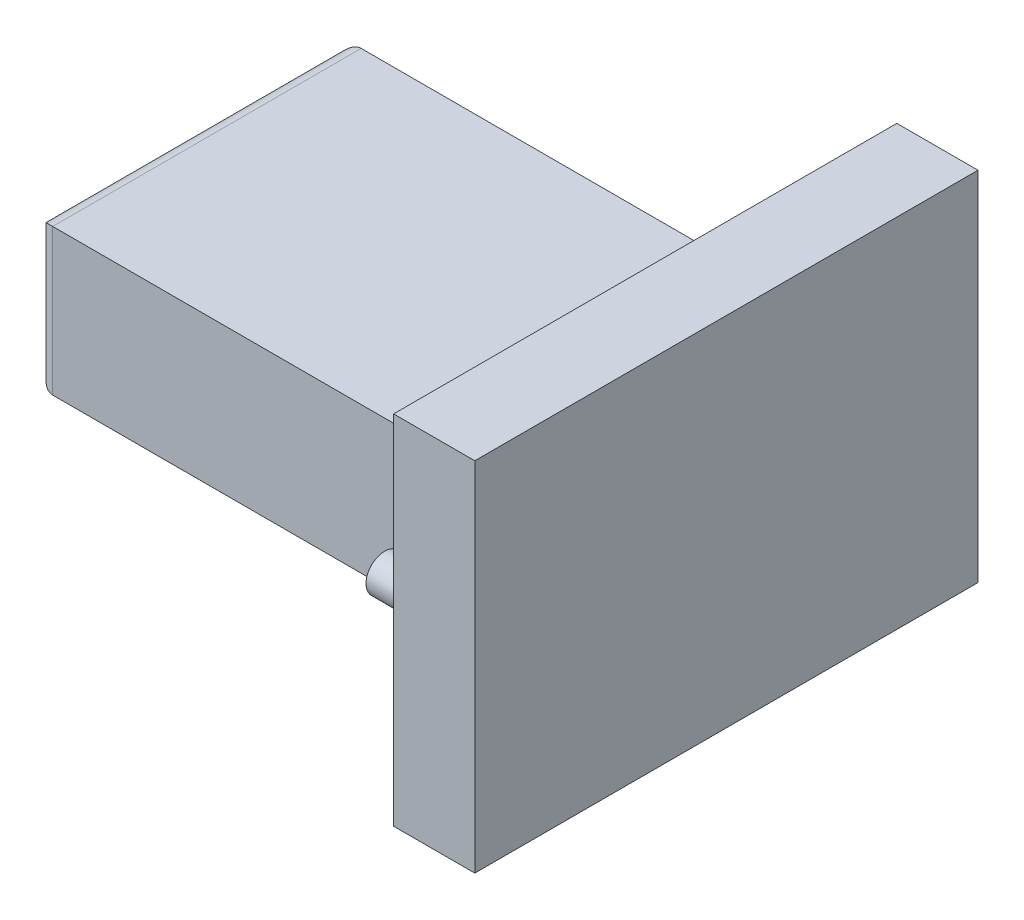
ISO-10303-21;
HEADER;
FILE_DESCRIPTION(('STEP AP214'),'2;1');
FILE_NAME('part.step','',(''),(''),'','','');
FILE_SCHEMA(('AUTOMOTIVE_DESIGN { 1 0 10303 214 1 1 1 1 }'));
ENDSEC;
DATA;
#1=APPLICATION_CONTEXT('core data for automotive mechanical design processes');
#2=APPLICATION_PROTOCOL_DEFINITION('international standard','automotive_design',2000,#1);
#3=PRODUCT_CONTEXT('',#1,'mechanical');
#4=PRODUCT('Part','Part','',(#3));
#5=PRODUCT_RELATED_PRODUCT_CATEGORY('part','',(#4));
#6=PRODUCT_DEFINITION_FORMATION('','',#4);
#7=PRODUCT_DEFINITION_CONTEXT('part definition',#1,'design');
#8=PRODUCT_DEFINITION('design','',#6,#7);
#9=PRODUCT_DEFINITION_SHAPE('','',#8);
#10=(LENGTH_UNIT() NAMED_UNIT(*) SI_UNIT(.MILLI.,.METRE.));
#11=(NAMED_UNIT(*) PLANE_ANGLE_UNIT() SI_UNIT($,.RADIAN.));
#12=(NAMED_UNIT(*) SI_UNIT($,.STERADIAN.) SOLID_ANGLE_UNIT());
#13=UNCERTAINTY_MEASURE_WITH_UNIT(LENGTH_MEASURE(1.E-05),#10,'distance_accuracy_value','');
#14=(GEOMETRIC_REPRESENTATION_CONTEXT(3) GLOBAL_UNCERTAINTY_ASSIGNED_CONTEXT((#13)) GLOBAL_UNIT_ASSIGNED_CONTEXT((#10,
#11,#12)) REPRESENTATION_CONTEXT('',''));
#15=CARTESIAN_POINT('',(0.,0.,0.));
#16=DIRECTION('',(0.,0.,1.));
#17=DIRECTION('',(1.,0.,0.));
#18=AXIS2_PLACEMENT_3D('',#15,#16,#17);
#19=CARTESIAN_POINT('',(5.,0.,0.));
#20=DIRECTION('',(0.,0.,-1.));
#21=DIRECTION('',(-1.,0.,0.));
#22=AXIS2_PLACEMENT_3D('',#19,#20,#21);
#23=PLANE('',#22);
#24=DIRECTION('',(0.,-1.,0.));
#25=VECTOR('',#24,1.);
#26=CARTESIAN_POINT('',(0.,0.,0.));
#27=LINE('',#26,#25);
#28=CARTESIAN_POINT('',(0.,22.,0.));
#29=VERTEX_POINT('',#28);
#30=CARTESIAN_POINT('',(0.,0.,0.));
#31=VERTEX_POINT('',#30);
#32=EDGE_CURVE('E152',#29,#31,#27,.T.);
#33=ORIENTED_EDGE('',*,*,#32,.T.);
#34=DIRECTION('',(-1.,0.,0.));
#35=VECTOR('',#34,1.);
#36=CARTESIAN_POINT('',(5.,0.,0.));
#37=LINE('',#36,#35);
#38=CARTESIAN_POINT('',(5.,0.,0.));
#39=VERTEX_POINT('',#38);
#40=EDGE_CURVE('E179',#39,#31,#37,.T.);
#41=ORIENTED_EDGE('',*,*,#40,.F.);
#42=DIRECTION('',(0.,-1.,0.));
#43=VECTOR('',#42,1.);
#44=CARTESIAN_POINT('',(5.,0.,0.));
#45=LINE('',#44,#43);
#46=CARTESIAN_POINT('',(5.,22.,0.));
#47=VERTEX_POINT('',#46);
#48=EDGE_CURVE('E153',#47,#39,#45,.T.);
#49=ORIENTED_EDGE('',*,*,#48,.F.);
#50=DIRECTION('',(-1.,0.,0.));
#51=VECTOR('',#50,1.);
#52=CARTESIAN_POINT('',(5.,22.,0.));
#53=LINE('',#52,#51);
#54=EDGE_CURVE('E163',#47,#29,#53,.T.);
#55=ORIENTED_EDGE('',*,*,#54,.T.);
#56=EDGE_LOOP('',(#33,#41,#49,#55));
#57=FACE_BOUND('',#56,.T.);
#58=ADVANCED_FACE('F45',(#57),#23,.F.);
#59=CARTESIAN_POINT('',(5.,0.,0.));
#60=DIRECTION('',(0.,1.,0.));
#61=DIRECTION('',(0.,0.,1.));
#62=AXIS2_PLACEMENT_3D('',#59,#60,#61);
#63=PLANE('',#62);
#64=DIRECTION('',(0.,0.,-1.));
#65=VECTOR('',#64,1.);
#66=CARTESIAN_POINT('',(0.,0.,0.));
#67=LINE('',#66,#65);
#68=CARTESIAN_POINT('',(0.,0.,-31.));
#69=VERTEX_POINT('',#68);
#70=EDGE_CURVE('E166',#31,#69,#67,.T.);
#71=ORIENTED_EDGE('',*,*,#70,.T.);
#72=DIRECTION('',(-1.,0.,0.));
#73=VECTOR('',#72,1.);
#74=CARTESIAN_POINT('',(5.,0.,-31.));
#75=LINE('',#74,#73);
#76=CARTESIAN_POINT('',(5.,0.,-31.));
#77=VERTEX_POINT('',#76);
#78=EDGE_CURVE('E176',#77,#69,#75,.T.);
#79=ORIENTED_EDGE('',*,*,#78,.F.);
#80=DIRECTION('',(0.,0.,-1.));
#81=VECTOR('',#80,1.);
#82=CARTESIAN_POINT('',(5.,0.,0.));
#83=LINE('',#82,#81);
#84=EDGE_CURVE('E156',#39,#77,#83,.T.);
#85=ORIENTED_EDGE('',*,*,#84,.F.);
#86=ORIENTED_EDGE('',*,*,#40,.T.);
#87=EDGE_LOOP('',(#71,#79,#85,#86));
#88=FACE_BOUND('',#87,.T.);
#89=ADVANCED_FACE('F229',(#88),#63,.F.);
#90=CARTESIAN_POINT('',(5.,0.,-31.));
#91=DIRECTION('',(0.,0.,1.));
#92=DIRECTION('',(1.,0.,0.));
#93=AXIS2_PLACEMENT_3D('',#90,#91,#92);
#94=PLANE('',#93);
#95=DIRECTION('',(0.,1.,0.));
#96=VECTOR('',#95,1.);
#97=CARTESIAN_POINT('',(0.,0.,-31.));
#98=LINE('',#97,#96);
#99=CARTESIAN_POINT('',(0.,22.,-31.));
#100=VERTEX_POINT('',#99);
#101=EDGE_CURVE('E168',#69,#100,#98,.T.);
#102=ORIENTED_EDGE('',*,*,#101,.T.);
#103=DIRECTION('',(-1.,0.,0.));
#104=VECTOR('',#103,1.);
#105=CARTESIAN_POINT('',(5.,22.,-31.));
#106=LINE('',#105,#104);
#107=CARTESIAN_POINT('',(5.,22.,-31.));
#108=VERTEX_POINT('',#107);
#109=EDGE_CURVE('E173',#108,#100,#106,.T.);
#110=ORIENTED_EDGE('',*,*,#109,.F.);
#111=DIRECTION('',(0.,1.,0.));
#112=VECTOR('',#111,1.);
#113=CARTESIAN_POINT('',(5.,0.,-31.));
#114=LINE('',#113,#112);
#115=EDGE_CURVE('E159',#77,#108,#114,.T.);
#116=ORIENTED_EDGE('',*,*,#115,.F.);
#117=ORIENTED_EDGE('',*,*,#78,.T.);
#118=EDGE_LOOP('',(#102,#110,#116,#117));
#119=FACE_BOUND('',#118,.T.);
#120=ADVANCED_FACE('F235',(#119),#94,.F.);
#121=CARTESIAN_POINT('',(5.,22.,0.));
#122=DIRECTION('',(0.,-1.,0.));
#123=DIRECTION('',(0.,0.,-1.));
#124=AXIS2_PLACEMENT_3D('',#121,#122,#123);
#125=PLANE('',#124);
#126=DIRECTION('',(0.,0.,1.));
#127=VECTOR('',#126,1.);
#128=CARTESIAN_POINT('',(0.,22.,0.));
#129=LINE('',#128,#127);
#130=EDGE_CURVE('E157',#100,#29,#129,.T.);
#131=ORIENTED_EDGE('',*,*,#130,.T.);
#132=ORIENTED_EDGE('',*,*,#54,.F.);
#133=DIRECTION('',(0.,0.,1.));
#134=VECTOR('',#133,1.);
#135=CARTESIAN_POINT('',(5.,22.,0.));
#136=LINE('',#135,#134);
#137=EDGE_CURVE('E161',#108,#47,#136,.T.);
#138=ORIENTED_EDGE('',*,*,#137,.F.);
#139=ORIENTED_EDGE('',*,*,#109,.T.);
#140=EDGE_LOOP('',(#131,#132,#138,#139));
#141=FACE_BOUND('',#140,.T.);
#142=ADVANCED_FACE('F302',(#141),#125,.F.);
#143=CARTESIAN_POINT('',(5.,0.,0.));
#144=DIRECTION('',(-1.,0.,0.));
#145=DIRECTION('',(0.,0.,1.));
#146=AXIS2_PLACEMENT_3D('',#143,#144,#145);
#147=PLANE('',#146);
#148=ORIENTED_EDGE('',*,*,#48,.T.);
#149=ORIENTED_EDGE('',*,*,#84,.T.);
#150=ORIENTED_EDGE('',*,*,#115,.T.);
#151=ORIENTED_EDGE('',*,*,#137,.T.);
#152=EDGE_LOOP('',(#148,#149,#150,#151));
#153=FACE_BOUND('',#152,.T.);
#154=ADVANCED_FACE('F299',(#153),#147,.F.);
#155=CARTESIAN_POINT('',(0.,0.,0.));
#156=DIRECTION('',(-1.,0.,0.));
#157=DIRECTION('',(0.,0.,1.));
#158=AXIS2_PLACEMENT_3D('',#155,#156,#157);
#159=PLANE('',#158);
#160=CARTESIAN_POINT('',(0.,11.,-28.75));
#161=DIRECTION('',(-1.,0.,0.));
#162=DIRECTION('',(0.,0.,1.));
#163=AXIS2_PLACEMENT_3D('',#160,#161,#162);
#164=CIRCLE('',#163,1.25);
#165=CARTESIAN_POINT('',(0.,11.,-27.5));
#166=VERTEX_POINT('',#165);
#167=EDGE_CURVE('E13',#166,#166,#164,.F.);
#168=ORIENTED_EDGE('',*,*,#167,.T.);
#169=EDGE_LOOP('',(#168));
#170=FACE_BOUND('',#169,.T.);
#171=CARTESIAN_POINT('',(0.,11.,-2.25));
#172=DIRECTION('',(-1.,0.,0.));
#173=DIRECTION('',(0.,0.,1.));
#174=AXIS2_PLACEMENT_3D('',#171,#172,#173);
#175=CIRCLE('',#174,1.25);
#176=CARTESIAN_POINT('',(0.,11.,-1.));
#177=VERTEX_POINT('',#176);
#178=EDGE_CURVE('E211',#177,#177,#175,.F.);
#179=ORIENTED_EDGE('',*,*,#178,.T.);
#180=EDGE_LOOP('',(#179));
#181=FACE_BOUND('',#180,.T.);
#182=DIRECTION('',(0.,-1.,0.));
#183=VECTOR('',#182,1.);
#184=CARTESIAN_POINT('',(0.,15.5,-25.));
#185=LINE('',#184,#183);
#186=CARTESIAN_POINT('',(0.,15.5,-25.));
#187=VERTEX_POINT('',#186);
#188=CARTESIAN_POINT('',(0.,6.5,-25.));
#189=VERTEX_POINT('',#188);
#190=EDGE_CURVE('E141',#187,#189,#185,.T.);
#191=ORIENTED_EDGE('',*,*,#190,.F.);
#192=DIRECTION('',(0.,0.,-1.));
#193=VECTOR('',#192,1.);
#194=CARTESIAN_POINT('',(0.,15.5,-25.));
#195=LINE('',#194,#193);
#196=CARTESIAN_POINT('',(0.,15.5,-6.));
#197=VERTEX_POINT('',#196);
#198=EDGE_CURVE('E138',#197,#187,#195,.T.);
#199=ORIENTED_EDGE('',*,*,#198,.F.);
#200=DIRECTION('',(0.,1.,0.));
#201=VECTOR('',#200,1.);
#202=CARTESIAN_POINT('',(0.,15.5,-6.));
#203=LINE('',#202,#201);
#204=CARTESIAN_POINT('',(0.,6.5,-6.));
#205=VERTEX_POINT('',#204);
#206=EDGE_CURVE('E124',#205,#197,#203,.T.);
#207=ORIENTED_EDGE('',*,*,#206,.F.);
#208=DIRECTION('',(0.,0.,1.));
#209=VECTOR('',#208,1.);
#210=CARTESIAN_POINT('',(0.,6.5,-25.));
#211=LINE('',#210,#209);
#212=EDGE_CURVE('E135',#189,#205,#211,.T.);
#213=ORIENTED_EDGE('',*,*,#212,.F.);
#214=EDGE_LOOP('',(#191,#199,#207,#213));
#215=FACE_BOUND('',#214,.T.);
#216=ORIENTED_EDGE('',*,*,#32,.F.);
#217=ORIENTED_EDGE('',*,*,#130,.F.);
#218=ORIENTED_EDGE('',*,*,#101,.F.);
#219=ORIENTED_EDGE('',*,*,#70,.F.);
#220=EDGE_LOOP('',(#216,#217,#218,#219));
#221=FACE_BOUND('',#220,.T.);
#222=ADVANCED_FACE('F133',(#170,#181,#215,#221),#159,.T.);
#223=CARTESIAN_POINT('',(-28.,15.5,-25.));
#224=DIRECTION('',(0.,0.,1.));
#225=DIRECTION('',(0.,-1.,0.));
#226=AXIS2_PLACEMENT_3D('',#223,#224,#225);
#227=PLANE('',#226);
#228=DIRECTION('',(1.,0.,0.));
#229=VECTOR('',#228,1.);
#230=CARTESIAN_POINT('',(-28.,6.5,-25.));
#231=LINE('',#230,#229);
#232=CARTESIAN_POINT('',(-27.,6.5,-25.));
#233=VERTEX_POINT('',#232);
#234=EDGE_CURVE('E126',#233,#189,#231,.T.);
#235=ORIENTED_EDGE('',*,*,#234,.F.);
#236=DIRECTION('',(0.,-1.,0.));
#237=VECTOR('',#236,1.);
#238=CARTESIAN_POINT('',(-27.,15.5,-25.));
#239=LINE('',#238,#237);
#240=CARTESIAN_POINT('',(-27.,15.5,-25.));
#241=VERTEX_POINT('',#240);
#242=EDGE_CURVE('E196',#233,#241,#239,.F.);
#243=ORIENTED_EDGE('',*,*,#242,.T.);
#244=DIRECTION('',(1.,0.,0.));
#245=VECTOR('',#244,1.);
#246=CARTESIAN_POINT('',(-28.,15.5,-25.));
#247=LINE('',#246,#245);
#248=EDGE_CURVE('E148',#241,#187,#247,.T.);
#249=ORIENTED_EDGE('',*,*,#248,.T.);
#250=ORIENTED_EDGE('',*,*,#190,.T.);
#251=EDGE_LOOP('',(#235,#243,#249,#250));
#252=FACE_BOUND('',#251,.T.);
#253=ADVANCED_FACE('F295',(#252),#227,.F.);
#254=CARTESIAN_POINT('',(-28.,6.5,-25.));
#255=DIRECTION('',(0.,1.,0.));
#256=DIRECTION('',(0.,0.,1.));
#257=AXIS2_PLACEMENT_3D('',#254,#255,#256);
#258=PLANE('',#257);
#259=DIRECTION('',(1.,0.,0.));
#260=VECTOR('',#259,1.);
#261=CARTESIAN_POINT('',(-28.,6.5,-6.));
#262=LINE('',#261,#260);
#263=CARTESIAN_POINT('',(-27.,6.5,-6.));
#264=VERTEX_POINT('',#263);
#265=EDGE_CURVE('E121',#264,#205,#262,.T.);
#266=ORIENTED_EDGE('',*,*,#265,.F.);
#267=DIRECTION('',(0.,0.,1.));
#268=VECTOR('',#267,1.);
#269=CARTESIAN_POINT('',(-27.,6.5,-25.));
#270=LINE('',#269,#268);
#271=EDGE_CURVE('E60',#264,#233,#270,.F.);
#272=ORIENTED_EDGE('',*,*,#271,.T.);
#273=ORIENTED_EDGE('',*,*,#234,.T.);
#274=ORIENTED_EDGE('',*,*,#212,.T.);
#275=EDGE_LOOP('',(#266,#272,#273,#274));
#276=FACE_BOUND('',#275,.T.);
#277=ADVANCED_FACE('F140',(#276),#258,.F.);
#278=CARTESIAN_POINT('',(-28.,15.5,-6.));
#279=DIRECTION('',(0.,0.,-1.));
#280=DIRECTION('',(-1.,0.,0.));
#281=AXIS2_PLACEMENT_3D('',#278,#279,#280);
#282=PLANE('',#281);
#283=DIRECTION('',(1.,0.,0.));
#284=VECTOR('',#283,1.);
#285=CARTESIAN_POINT('',(-28.,15.5,-6.));
#286=LINE('',#285,#284);
#287=CARTESIAN_POINT('',(-27.,15.5,-6.));
#288=VERTEX_POINT('',#287);
#289=EDGE_CURVE('E127',#288,#197,#286,.T.);
#290=ORIENTED_EDGE('',*,*,#289,.F.);
#291=DIRECTION('',(0.,1.,0.));
#292=VECTOR('',#291,1.);
#293=CARTESIAN_POINT('',(-27.,6.5,-6.));
#294=LINE('',#293,#292);
#295=EDGE_CURVE('E68',#288,#264,#294,.F.);
#296=ORIENTED_EDGE('',*,*,#295,.T.);
#297=ORIENTED_EDGE('',*,*,#265,.T.);
#298=ORIENTED_EDGE('',*,*,#206,.T.);
#299=EDGE_LOOP('',(#290,#296,#297,#298));
#300=FACE_BOUND('',#299,.T.);
#301=ADVANCED_FACE('F123',(#300),#282,.F.);
#302=CARTESIAN_POINT('',(-28.,15.5,-25.));
#303=DIRECTION('',(0.,-1.,0.));
#304=DIRECTION('',(0.,0.,-1.));
#305=AXIS2_PLACEMENT_3D('',#302,#303,#304);
#306=PLANE('',#305);
#307=ORIENTED_EDGE('',*,*,#248,.F.);
#308=DIRECTION('',(0.,0.,-1.));
#309=VECTOR('',#308,1.);
#310=CARTESIAN_POINT('',(-27.,15.5,-6.));
#311=LINE('',#310,#309);
#312=EDGE_CURVE('E191',#241,#288,#311,.F.);
#313=ORIENTED_EDGE('',*,*,#312,.T.);
#314=ORIENTED_EDGE('',*,*,#289,.T.);
#315=ORIENTED_EDGE('',*,*,#198,.T.);
#316=EDGE_LOOP('',(#307,#313,#314,#315));
#317=FACE_BOUND('',#316,.T.);
#318=ADVANCED_FACE('F286',(#317),#306,.F.);
#319=CARTESIAN_POINT('',(-28.,0.,0.));
#320=DIRECTION('',(-1.,0.,0.));
#321=DIRECTION('',(0.,0.,1.));
#322=AXIS2_PLACEMENT_3D('',#319,#320,#321);
#323=PLANE('',#322);
#324=DIRECTION('',(0.,1.,0.));
#325=VECTOR('',#324,1.);
#326=CARTESIAN_POINT('',(-28.,15.5,-7.));
#327=LINE('',#326,#325);
#328=CARTESIAN_POINT('',(-28.,7.5,-7.));
#329=VERTEX_POINT('',#328);
#330=CARTESIAN_POINT('',(-28.,14.5,-7.));
#331=VERTEX_POINT('',#330);
#332=EDGE_CURVE('E186',#329,#331,#327,.T.);
#333=ORIENTED_EDGE('',*,*,#332,.T.);
#334=DIRECTION('',(0.,0.,-1.));
#335=VECTOR('',#334,1.);
#336=CARTESIAN_POINT('',(-28.,14.5,-25.));
#337=LINE('',#336,#335);
#338=CARTESIAN_POINT('',(-28.,14.5,-24.));
#339=VERTEX_POINT('',#338);
#340=EDGE_CURVE('E188',#331,#339,#337,.T.);
#341=ORIENTED_EDGE('',*,*,#340,.T.);
#342=DIRECTION('',(0.,-1.,0.));
#343=VECTOR('',#342,1.);
#344=CARTESIAN_POINT('',(-28.,6.5,-24.));
#345=LINE('',#344,#343);
#346=CARTESIAN_POINT('',(-28.,7.5,-24.));
#347=VERTEX_POINT('',#346);
#348=EDGE_CURVE('E182',#339,#347,#345,.T.);
#349=ORIENTED_EDGE('',*,*,#348,.T.);
#350=DIRECTION('',(0.,0.,1.));
#351=VECTOR('',#350,1.);
#352=CARTESIAN_POINT('',(-28.,7.5,-6.));
#353=LINE('',#352,#351);
#354=EDGE_CURVE('E184',#347,#329,#353,.T.);
#355=ORIENTED_EDGE('',*,*,#354,.T.);
#356=EDGE_LOOP('',(#333,#341,#349,#355));
#357=FACE_BOUND('',#356,.T.);
#358=ADVANCED_FACE('F255',(#357),#323,.T.);
#359=CARTESIAN_POINT('',(-27.,7.5,0.));
#360=DIRECTION('',(0.,0.,-1.));
#361=DIRECTION('',(-1.,0.,0.));
#362=AXIS2_PLACEMENT_3D('',#359,#360,#361);
#363=CYLINDRICAL_SURFACE('',#362,1.);
#364=CARTESIAN_POINT('',(-27.,7.5,-24.));
#365=DIRECTION('',(0.,0.707106781186547,-0.707106781186548));
#366=DIRECTION('',(0.,0.707106781186548,0.707106781186547));
#367=AXIS2_PLACEMENT_3D('',#364,#365,#366);
#368=ELLIPSE('',#367,1.41421356237309,1.);
#369=EDGE_CURVE('E204',#233,#347,#368,.T.);
#370=ORIENTED_EDGE('',*,*,#369,.F.);
#371=ORIENTED_EDGE('',*,*,#271,.F.);
#372=CARTESIAN_POINT('',(-27.,7.5,-7.));
#373=DIRECTION('',(0.,-0.707106781186547,-0.707106781186547));
#374=DIRECTION('',(0.,0.707106781186547,-0.707106781186547));
#375=AXIS2_PLACEMENT_3D('',#372,#373,#374);
#376=ELLIPSE('',#375,1.41421356237309,1.);
#377=EDGE_CURVE('E143',#329,#264,#376,.F.);
#378=ORIENTED_EDGE('',*,*,#377,.F.);
#379=ORIENTED_EDGE('',*,*,#354,.F.);
#380=EDGE_LOOP('',(#370,#371,#378,#379));
#381=FACE_BOUND('',#380,.T.);
#382=ADVANCED_FACE('F252',(#381),#363,.T.);
#383=CARTESIAN_POINT('',(-27.,0.,-7.));
#384=DIRECTION('',(0.,-1.,0.));
#385=DIRECTION('',(0.,0.,-1.));
#386=AXIS2_PLACEMENT_3D('',#383,#384,#385);
#387=CYLINDRICAL_SURFACE('',#386,1.);
#388=ORIENTED_EDGE('',*,*,#377,.T.);
#389=ORIENTED_EDGE('',*,*,#295,.F.);
#390=CARTESIAN_POINT('',(-27.,14.5,-7.));
#391=DIRECTION('',(0.,-0.707106781186547,0.707106781186547));
#392=DIRECTION('',(0.,-0.707106781186547,-0.707106781186547));
#393=AXIS2_PLACEMENT_3D('',#390,#391,#392);
#394=ELLIPSE('',#393,1.41421356237309,1.);
#395=EDGE_CURVE('E201',#331,#288,#394,.F.);
#396=ORIENTED_EDGE('',*,*,#395,.F.);
#397=ORIENTED_EDGE('',*,*,#332,.F.);
#398=EDGE_LOOP('',(#388,#389,#396,#397));
#399=FACE_BOUND('',#398,.T.);
#400=ADVANCED_FACE('F248',(#399),#387,.T.);
#401=CARTESIAN_POINT('',(-27.,0.,-24.));
#402=DIRECTION('',(0.,1.,0.));
#403=DIRECTION('',(0.,0.,1.));
#404=AXIS2_PLACEMENT_3D('',#401,#402,#403);
#405=CYLINDRICAL_SURFACE('',#404,1.);
#406=ORIENTED_EDGE('',*,*,#369,.T.);
#407=ORIENTED_EDGE('',*,*,#348,.F.);
#408=CARTESIAN_POINT('',(-27.,14.5,-24.));
#409=DIRECTION('',(0.,0.707106781186548,0.707106781186547));
#410=DIRECTION('',(0.,0.707106781186547,-0.707106781186548));
#411=AXIS2_PLACEMENT_3D('',#408,#409,#410);
#412=ELLIPSE('',#411,1.4142135623731,1.);
#413=EDGE_CURVE('E199',#241,#339,#412,.T.);
#414=ORIENTED_EDGE('',*,*,#413,.F.);
#415=ORIENTED_EDGE('',*,*,#242,.F.);
#416=EDGE_LOOP('',(#406,#407,#414,#415));
#417=FACE_BOUND('',#416,.T.);
#418=ADVANCED_FACE('F244',(#417),#405,.T.);
#419=CARTESIAN_POINT('',(-27.,14.5,0.));
#420=DIRECTION('',(0.,0.,1.));
#421=DIRECTION('',(1.,0.,0.));
#422=AXIS2_PLACEMENT_3D('',#419,#420,#421);
#423=CYLINDRICAL_SURFACE('',#422,1.);
#424=ORIENTED_EDGE('',*,*,#395,.T.);
#425=ORIENTED_EDGE('',*,*,#312,.F.);
#426=ORIENTED_EDGE('',*,*,#413,.T.);
#427=ORIENTED_EDGE('',*,*,#340,.F.);
#428=EDGE_LOOP('',(#424,#425,#426,#427));
#429=FACE_BOUND('',#428,.T.);
#430=ADVANCED_FACE('F240',(#429),#423,.T.);
#431=CARTESIAN_POINT('',(-2.8,11.,-2.25));
#432=DIRECTION('',(1.,0.,0.));
#433=DIRECTION('',(0.,0.,-1.));
#434=AXIS2_PLACEMENT_3D('',#431,#432,#433);
#435=CYLINDRICAL_SURFACE('',#434,1.15);
#436=CARTESIAN_POINT('',(-0.0999999999999998,11.,-2.25));
#437=DIRECTION('',(-1.,0.,0.));
#438=DIRECTION('',(0.,0.,1.));
#439=AXIS2_PLACEMENT_3D('',#436,#437,#438);
#440=CIRCLE('',#439,1.15);
#441=CARTESIAN_POINT('',(-0.0999999999999998,11.,-1.1));
#442=VERTEX_POINT('',#441);
#443=EDGE_CURVE('E198',#442,#442,#440,.T.);
#444=ORIENTED_EDGE('',*,*,#443,.T.);
#445=EDGE_LOOP('',(#444));
#446=FACE_BOUND('',#445,.T.);
#447=CARTESIAN_POINT('',(-2.8,11.,-2.25));
#448=DIRECTION('',(-1.,0.,0.));
#449=DIRECTION('',(0.,0.,1.));
#450=AXIS2_PLACEMENT_3D('',#447,#448,#449);
#451=CIRCLE('',#450,1.15);
#452=CARTESIAN_POINT('',(-2.8,11.,-1.1));
#453=VERTEX_POINT('',#452);
#454=EDGE_CURVE('E202',#453,#453,#451,.T.);
#455=ORIENTED_EDGE('',*,*,#454,.F.);
#456=EDGE_LOOP('',(#455));
#457=FACE_BOUND('',#456,.T.);
#458=ADVANCED_FACE('F243',(#446,#457),#435,.T.);
#459=CARTESIAN_POINT('',(-2.8,11.,-2.25));
#460=DIRECTION('',(-1.,0.,0.));
#461=DIRECTION('',(0.,0.,1.));
#462=AXIS2_PLACEMENT_3D('',#459,#460,#461);
#463=PLANE('',#462);
#464=ORIENTED_EDGE('',*,*,#454,.T.);
#465=EDGE_LOOP('',(#464));
#466=FACE_BOUND('',#465,.T.);
#467=ADVANCED_FACE('F259',(#466),#463,.T.);
#468=CARTESIAN_POINT('',(-0.0999999999999998,11.,-2.25));
#469=DIRECTION('',(-1.,0.,0.));
#470=DIRECTION('',(0.,0.,1.));
#471=AXIS2_PLACEMENT_3D('',#468,#469,#470);
#472=TOROIDAL_SURFACE('',#471,1.25,0.1);
#473=ORIENTED_EDGE('',*,*,#178,.F.);
#474=EDGE_LOOP('',(#473));
#475=FACE_BOUND('',#474,.T.);
#476=ORIENTED_EDGE('',*,*,#443,.F.);
#477=EDGE_LOOP('',(#476));
#478=FACE_BOUND('',#477,.T.);
#479=ADVANCED_FACE('F257',(#475,#478),#472,.F.);
#480=CARTESIAN_POINT('',(-2.8,11.,-28.75));
#481=DIRECTION('',(1.,0.,0.));
#482=DIRECTION('',(0.,0.,-1.));
#483=AXIS2_PLACEMENT_3D('',#480,#481,#482);
#484=CYLINDRICAL_SURFACE('',#483,1.15);
#485=CARTESIAN_POINT('',(-0.0999999999999998,11.,-28.75));
#486=DIRECTION('',(-1.,0.,0.));
#487=DIRECTION('',(0.,0.,1.));
#488=AXIS2_PLACEMENT_3D('',#485,#486,#487);
#489=CIRCLE('',#488,1.15);
#490=CARTESIAN_POINT('',(-0.0999999999999998,11.,-27.6));
#491=VERTEX_POINT('',#490);
#492=EDGE_CURVE('E53',#491,#491,#489,.T.);
#493=ORIENTED_EDGE('',*,*,#492,.T.);
#494=EDGE_LOOP('',(#493));
#495=FACE_BOUND('',#494,.T.);
#496=CARTESIAN_POINT('',(-2.8,11.,-28.75));
#497=DIRECTION('',(-1.,0.,0.));
#498=DIRECTION('',(0.,0.,1.));
#499=AXIS2_PLACEMENT_3D('',#496,#497,#498);
#500=CIRCLE('',#499,1.15);
#501=CARTESIAN_POINT('',(-2.8,11.,-27.6));
#502=VERTEX_POINT('',#501);
#503=EDGE_CURVE('E277',#502,#502,#500,.T.);
#504=ORIENTED_EDGE('',*,*,#503,.F.);
#505=EDGE_LOOP('',(#504));
#506=FACE_BOUND('',#505,.T.);
#507=ADVANCED_FACE('F216',(#495,#506),#484,.T.);
#508=CARTESIAN_POINT('',(-2.8,11.,-28.75));
#509=DIRECTION('',(-1.,0.,0.));
#510=DIRECTION('',(0.,0.,1.));
#511=AXIS2_PLACEMENT_3D('',#508,#509,#510);
#512=PLANE('',#511);
#513=ORIENTED_EDGE('',*,*,#503,.T.);
#514=EDGE_LOOP('',(#513));
#515=FACE_BOUND('',#514,.T.);
#516=ADVANCED_FACE('F220',(#515),#512,.T.);
#517=CARTESIAN_POINT('',(-0.0999999999999998,11.,-28.75));
#518=DIRECTION('',(-1.,0.,0.));
#519=DIRECTION('',(0.,0.,1.));
#520=AXIS2_PLACEMENT_3D('',#517,#518,#519);
#521=TOROIDAL_SURFACE('',#520,1.25,0.1);
#522=ORIENTED_EDGE('',*,*,#167,.F.);
#523=EDGE_LOOP('',(#522));
#524=FACE_BOUND('',#523,.T.);
#525=ORIENTED_EDGE('',*,*,#492,.F.);
#526=EDGE_LOOP('',(#525));
#527=FACE_BOUND('',#526,.T.);
#528=ADVANCED_FACE('F47',(#524,#527),#521,.F.);
#529=CLOSED_SHELL('',(#58,#89,#120,#142,#154,#222,#253,#277,#301,#318,#358,#382,#400,#418,#430,
#458,#467,#479,#507,#516,#528));
#530=MANIFOLD_SOLID_BREP('B2',#529);
#531=ADVANCED_BREP_SHAPE_REPRESENTATION('',(#18,#530),#14);
#532=SHAPE_DEFINITION_REPRESENTATION(#9,#531);
ENDSEC;
END-ISO-10303-21;
